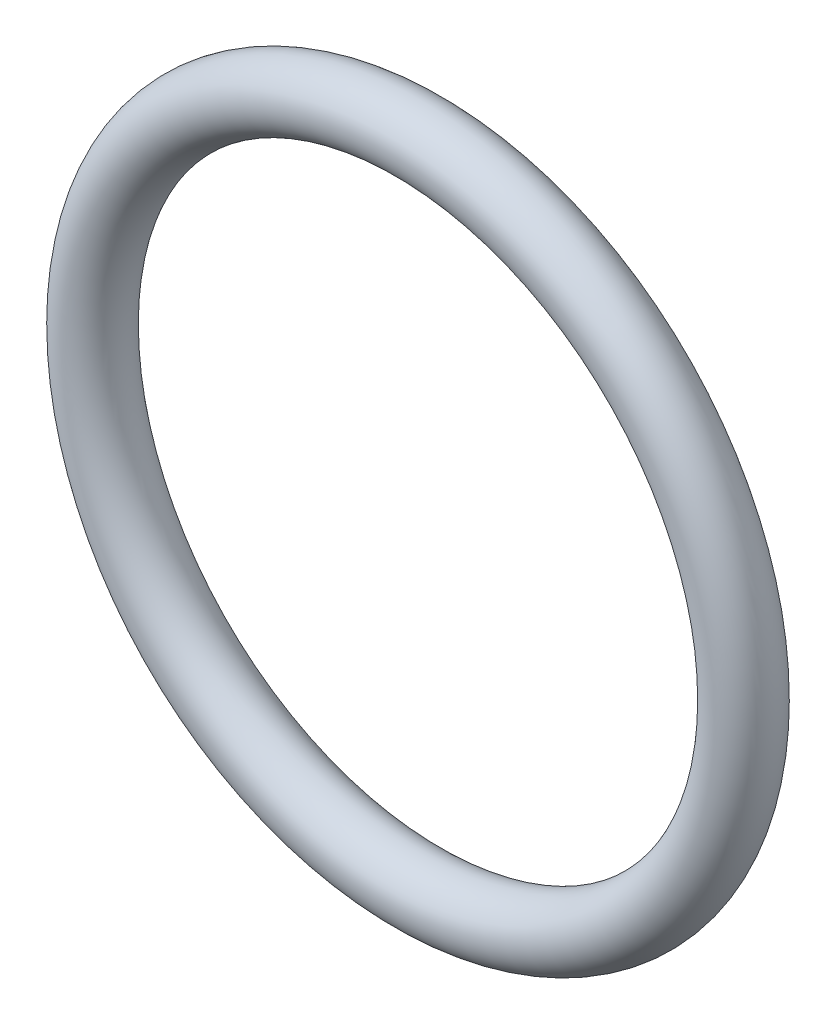
ISO-10303-21;
HEADER;
FILE_DESCRIPTION(('STEP AP214'),'2;1');
FILE_NAME('part.step','',(''),(''),'','','');
FILE_SCHEMA(('AUTOMOTIVE_DESIGN { 1 0 10303 214 1 1 1 1 }'));
ENDSEC;
DATA;
#1=APPLICATION_CONTEXT('core data for automotive mechanical design processes');
#2=APPLICATION_PROTOCOL_DEFINITION('international standard','automotive_design',2000,#1);
#3=PRODUCT_CONTEXT('',#1,'mechanical');
#4=PRODUCT('Part','Part','',(#3));
#5=PRODUCT_RELATED_PRODUCT_CATEGORY('part','',(#4));
#6=PRODUCT_DEFINITION_FORMATION('','',#4);
#7=PRODUCT_DEFINITION_CONTEXT('part definition',#1,'design');
#8=PRODUCT_DEFINITION('design','',#6,#7);
#9=PRODUCT_DEFINITION_SHAPE('','',#8);
#10=(LENGTH_UNIT() NAMED_UNIT(*) SI_UNIT(.MILLI.,.METRE.));
#11=(NAMED_UNIT(*) PLANE_ANGLE_UNIT() SI_UNIT($,.RADIAN.));
#12=(NAMED_UNIT(*) SI_UNIT($,.STERADIAN.) SOLID_ANGLE_UNIT());
#13=UNCERTAINTY_MEASURE_WITH_UNIT(LENGTH_MEASURE(1.E-05),#10,'distance_accuracy_value','');
#14=(GEOMETRIC_REPRESENTATION_CONTEXT(3) GLOBAL_UNCERTAINTY_ASSIGNED_CONTEXT((#13)) GLOBAL_UNIT_ASSIGNED_CONTEXT((#10,
#11,#12)) REPRESENTATION_CONTEXT('',''));
#15=CARTESIAN_POINT('',(0.,0.,0.));
#16=DIRECTION('',(0.,0.,1.));
#17=DIRECTION('',(1.,0.,0.));
#18=AXIS2_PLACEMENT_3D('',#15,#16,#17);
#19=CARTESIAN_POINT('',(0.,0.,0.));
#20=DIRECTION('',(0.,0.,-1.));
#21=DIRECTION('',(-1.,0.,0.));
#22=AXIS2_PLACEMENT_3D('',#19,#20,#21);
#23=TOROIDAL_SURFACE('',#22,12.05,1.2);
#24=CARTESIAN_POINT('',(-13.25,0.,0.));
#25=VERTEX_POINT('',#24);
#26=VERTEX_LOOP('',#25);
#27=FACE_BOUND('',#26,.T.);
#28=ADVANCED_FACE('F29',(#27),#23,.T.);
#29=CLOSED_SHELL('',(#28));
#30=MANIFOLD_SOLID_BREP('B2',#29);
#31=ADVANCED_BREP_SHAPE_REPRESENTATION('',(#18,#30),#14);
#32=SHAPE_DEFINITION_REPRESENTATION(#9,#31);
ENDSEC;
END-ISO-10303-21;
